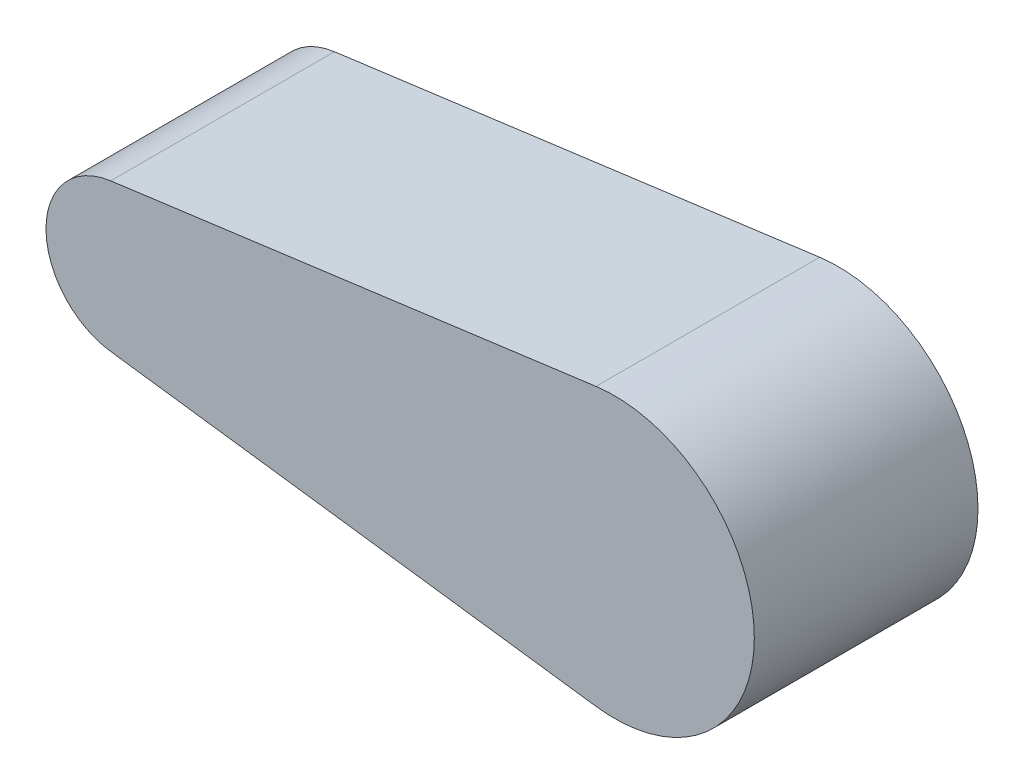
ISO-10303-21;
HEADER;
FILE_DESCRIPTION(('STEP AP214'),'2;1');
FILE_NAME('part.step','',(''),(''),'','','');
FILE_SCHEMA(('AUTOMOTIVE_DESIGN { 1 0 10303 214 1 1 1 1 }'));
ENDSEC;
DATA;
#1=APPLICATION_CONTEXT('core data for automotive mechanical design processes');
#2=APPLICATION_PROTOCOL_DEFINITION('international standard','automotive_design',2000,#1);
#3=PRODUCT_CONTEXT('',#1,'mechanical');
#4=PRODUCT('Part','Part','',(#3));
#5=PRODUCT_RELATED_PRODUCT_CATEGORY('part','',(#4));
#6=PRODUCT_DEFINITION_FORMATION('','',#4);
#7=PRODUCT_DEFINITION_CONTEXT('part definition',#1,'design');
#8=PRODUCT_DEFINITION('design','',#6,#7);
#9=PRODUCT_DEFINITION_SHAPE('','',#8);
#10=(LENGTH_UNIT() NAMED_UNIT(*) SI_UNIT(.MILLI.,.METRE.));
#11=(NAMED_UNIT(*) PLANE_ANGLE_UNIT() SI_UNIT($,.RADIAN.));
#12=(NAMED_UNIT(*) SI_UNIT($,.STERADIAN.) SOLID_ANGLE_UNIT());
#13=UNCERTAINTY_MEASURE_WITH_UNIT(LENGTH_MEASURE(1.E-05),#10,'distance_accuracy_value','');
#14=(GEOMETRIC_REPRESENTATION_CONTEXT(3) GLOBAL_UNCERTAINTY_ASSIGNED_CONTEXT((#13)) GLOBAL_UNIT_ASSIGNED_CONTEXT((#10,
#11,#12)) REPRESENTATION_CONTEXT('',''));
#15=CARTESIAN_POINT('',(0.,0.,0.));
#16=DIRECTION('',(0.,0.,1.));
#17=DIRECTION('',(1.,0.,0.));
#18=AXIS2_PLACEMENT_3D('',#15,#16,#17);
#19=CARTESIAN_POINT('',(-150.,0.,120.));
#20=DIRECTION('',(0.,0.,-1.));
#21=DIRECTION('',(-1.,0.,0.));
#22=AXIS2_PLACEMENT_3D('',#19,#20,#21);
#23=CYLINDRICAL_SURFACE('',#22,40.);
#24=CARTESIAN_POINT('',(-150.,0.,0.));
#25=DIRECTION('',(0.,0.,1.));
#26=DIRECTION('',(1.,0.,0.));
#27=AXIS2_PLACEMENT_3D('',#24,#25,#26);
#28=CIRCLE('',#27,40.);
#29=CARTESIAN_POINT('',(-155.283018867925,39.6495865254753,0.));
#30=VERTEX_POINT('',#29);
#31=CARTESIAN_POINT('',(-154.307692307692,-39.7673708834548,0.));
#32=VERTEX_POINT('',#31);
#33=EDGE_CURVE('E93',#30,#32,#28,.T.);
#34=ORIENTED_EDGE('',*,*,#33,.T.);
#35=DIRECTION('',(0.,0.,-1.));
#36=VECTOR('',#35,1.);
#37=CARTESIAN_POINT('',(-154.307692307692,-39.7673708834548,120.));
#38=LINE('',#37,#36);
#39=CARTESIAN_POINT('',(-154.307692307692,-39.7673708834548,120.));
#40=VERTEX_POINT('',#39);
#41=EDGE_CURVE('E11',#40,#32,#38,.T.);
#42=ORIENTED_EDGE('',*,*,#41,.F.);
#43=CARTESIAN_POINT('',(-150.,0.,120.));
#44=DIRECTION('',(0.,0.,1.));
#45=DIRECTION('',(1.,0.,0.));
#46=AXIS2_PLACEMENT_3D('',#43,#44,#45);
#47=CIRCLE('',#46,40.);
#48=CARTESIAN_POINT('',(-155.283018867925,39.6495865254753,120.));
#49=VERTEX_POINT('',#48);
#50=EDGE_CURVE('E81',#49,#40,#47,.T.);
#51=ORIENTED_EDGE('',*,*,#50,.F.);
#52=DIRECTION('',(0.,0.,-1.));
#53=VECTOR('',#52,1.);
#54=CARTESIAN_POINT('',(-155.283018867925,39.6495865254753,120.));
#55=LINE('',#54,#53);
#56=EDGE_CURVE('E89',#49,#30,#55,.T.);
#57=ORIENTED_EDGE('',*,*,#56,.T.);
#58=EDGE_LOOP('',(#34,#42,#51,#57));
#59=FACE_BOUND('',#58,.T.);
#60=ADVANCED_FACE('F30',(#59),#23,.T.);
#61=CARTESIAN_POINT('',(-154.307692307692,-39.7673708834548,120.));
#62=DIRECTION('',(0.132121167987794,0.991233573366813,0.));
#63=DIRECTION('',(-0.991233573366813,0.132121167987794,0.));
#64=AXIS2_PLACEMENT_3D('',#61,#62,#63);
#65=PLANE('',#64);
#66=DIRECTION('',(0.991233573366813,-0.132121167987794,0.));
#67=VECTOR('',#66,1.);
#68=CARTESIAN_POINT('',(-154.307692307692,-39.7673708834548,0.));
#69=LINE('',#68,#67);
#70=CARTESIAN_POINT('',(105.090912400915,-74.342518002511,0.));
#71=VERTEX_POINT('',#70);
#72=EDGE_CURVE('E85',#32,#71,#69,.T.);
#73=ORIENTED_EDGE('',*,*,#72,.T.);
#74=DIRECTION('',(0.,0.,-1.));
#75=VECTOR('',#74,1.);
#76=CARTESIAN_POINT('',(105.090912400915,-74.342518002511,120.));
#77=LINE('',#76,#75);
#78=CARTESIAN_POINT('',(105.090912400915,-74.342518002511,120.));
#79=VERTEX_POINT('',#78);
#80=EDGE_CURVE('E38',#79,#71,#77,.T.);
#81=ORIENTED_EDGE('',*,*,#80,.F.);
#82=DIRECTION('',(0.991233573366813,-0.132121167987794,0.));
#83=VECTOR('',#82,1.);
#84=CARTESIAN_POINT('',(-154.307692307692,-39.7673708834548,120.));
#85=LINE('',#84,#83);
#86=EDGE_CURVE('E76',#40,#79,#85,.T.);
#87=ORIENTED_EDGE('',*,*,#86,.F.);
#88=ORIENTED_EDGE('',*,*,#41,.T.);
#89=EDGE_LOOP('',(#73,#81,#87,#88));
#90=FACE_BOUND('',#89,.T.);
#91=ADVANCED_FACE('F84',(#90),#65,.F.);
#92=CARTESIAN_POINT('',(115.,0.,120.));
#93=DIRECTION('',(0.,0.,-1.));
#94=DIRECTION('',(-1.,0.,0.));
#95=AXIS2_PLACEMENT_3D('',#92,#93,#94);
#96=CYLINDRICAL_SURFACE('',#95,75.);
#97=CARTESIAN_POINT('',(115.,0.,0.));
#98=DIRECTION('',(0.,0.,1.));
#99=DIRECTION('',(1.,0.,0.));
#100=AXIS2_PLACEMENT_3D('',#97,#98,#99);
#101=CIRCLE('',#100,75.);
#102=CARTESIAN_POINT('',(105.094339622641,74.3429747352662,0.));
#103=VERTEX_POINT('',#102);
#104=EDGE_CURVE('E63',#71,#103,#101,.T.);
#105=ORIENTED_EDGE('',*,*,#104,.T.);
#106=DIRECTION('',(0.,0.,-1.));
#107=VECTOR('',#106,1.);
#108=CARTESIAN_POINT('',(105.094339622641,74.3429747352662,120.));
#109=LINE('',#108,#107);
#110=CARTESIAN_POINT('',(105.094339622641,74.3429747352662,120.));
#111=VERTEX_POINT('',#110);
#112=EDGE_CURVE('E86',#111,#103,#109,.T.);
#113=ORIENTED_EDGE('',*,*,#112,.F.);
#114=CARTESIAN_POINT('',(115.,0.,120.));
#115=DIRECTION('',(0.,0.,1.));
#116=DIRECTION('',(1.,0.,0.));
#117=AXIS2_PLACEMENT_3D('',#114,#115,#116);
#118=CIRCLE('',#117,75.);
#119=EDGE_CURVE('E79',#79,#111,#118,.T.);
#120=ORIENTED_EDGE('',*,*,#119,.F.);
#121=ORIENTED_EDGE('',*,*,#80,.T.);
#122=EDGE_LOOP('',(#105,#113,#120,#121));
#123=FACE_BOUND('',#122,.T.);
#124=ADVANCED_FACE('F87',(#123),#96,.T.);
#125=CARTESIAN_POINT('',(-155.283018867925,39.6495865254753,120.));
#126=DIRECTION('',(0.132075471698113,-0.991239663136883,0.));
#127=DIRECTION('',(0.991239663136883,0.132075471698113,0.));
#128=AXIS2_PLACEMENT_3D('',#125,#126,#127);
#129=PLANE('',#128);
#130=DIRECTION('',(-0.991239663136883,-0.132075471698113,0.));
#131=VECTOR('',#130,1.);
#132=CARTESIAN_POINT('',(-155.283018867925,39.6495865254753,0.));
#133=LINE('',#132,#131);
#134=EDGE_CURVE('E69',#103,#30,#133,.T.);
#135=ORIENTED_EDGE('',*,*,#134,.T.);
#136=ORIENTED_EDGE('',*,*,#56,.F.);
#137=DIRECTION('',(-0.991239663136883,-0.132075471698113,0.));
#138=VECTOR('',#137,1.);
#139=CARTESIAN_POINT('',(-155.283018867925,39.6495865254753,120.));
#140=LINE('',#139,#138);
#141=EDGE_CURVE('E46',#111,#49,#140,.T.);
#142=ORIENTED_EDGE('',*,*,#141,.F.);
#143=ORIENTED_EDGE('',*,*,#112,.T.);
#144=EDGE_LOOP('',(#135,#136,#142,#143));
#145=FACE_BOUND('',#144,.T.);
#146=ADVANCED_FACE('F100',(#145),#129,.F.);
#147=CARTESIAN_POINT('',(-150.,0.,120.));
#148=DIRECTION('',(0.,0.,1.));
#149=DIRECTION('',(1.,0.,0.));
#150=AXIS2_PLACEMENT_3D('',#147,#148,#149);
#151=PLANE('',#150);
#152=ORIENTED_EDGE('',*,*,#50,.T.);
#153=ORIENTED_EDGE('',*,*,#86,.T.);
#154=ORIENTED_EDGE('',*,*,#119,.T.);
#155=ORIENTED_EDGE('',*,*,#141,.T.);
#156=EDGE_LOOP('',(#152,#153,#154,#155));
#157=FACE_BOUND('',#156,.T.);
#158=ADVANCED_FACE('F77',(#157),#151,.T.);
#159=CARTESIAN_POINT('',(-150.,0.,0.));
#160=DIRECTION('',(0.,0.,1.));
#161=DIRECTION('',(1.,0.,0.));
#162=AXIS2_PLACEMENT_3D('',#159,#160,#161);
#163=PLANE('',#162);
#164=ORIENTED_EDGE('',*,*,#33,.F.);
#165=ORIENTED_EDGE('',*,*,#134,.F.);
#166=ORIENTED_EDGE('',*,*,#104,.F.);
#167=ORIENTED_EDGE('',*,*,#72,.F.);
#168=EDGE_LOOP('',(#164,#165,#166,#167));
#169=FACE_BOUND('',#168,.T.);
#170=ADVANCED_FACE('F103',(#169),#163,.F.);
#171=CLOSED_SHELL('',(#60,#91,#124,#146,#158,#170));
#172=MANIFOLD_SOLID_BREP('B2',#171);
#173=ADVANCED_BREP_SHAPE_REPRESENTATION('',(#18,#172),#14);
#174=SHAPE_DEFINITION_REPRESENTATION(#9,#173);
ENDSEC;
END-ISO-10303-21;
